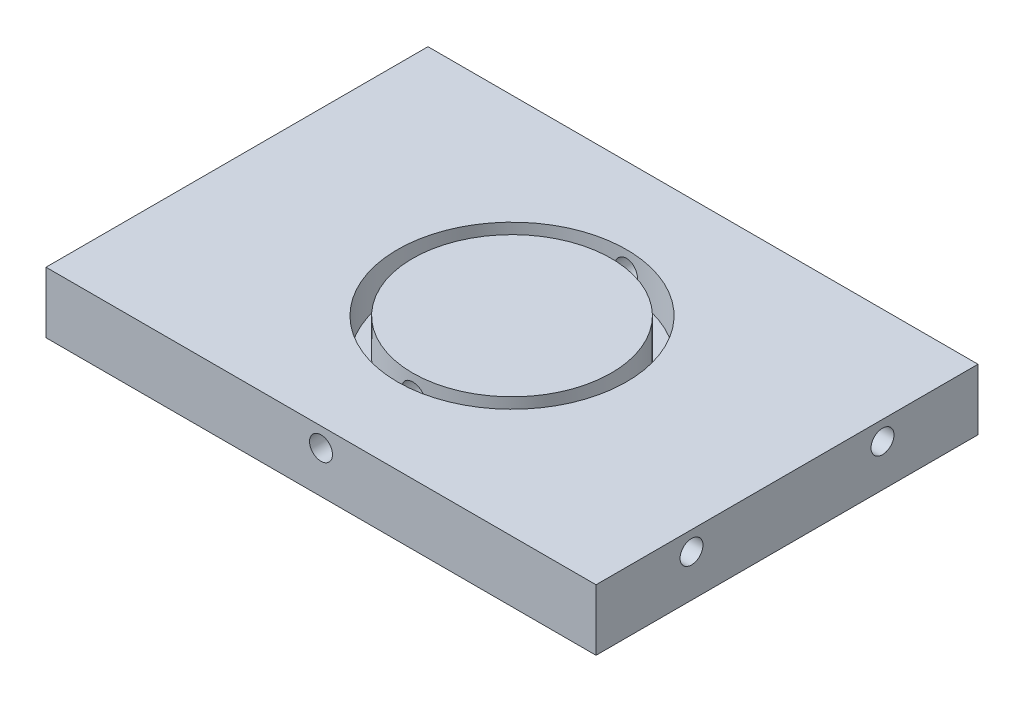
ISO-10303-21;
HEADER;
FILE_DESCRIPTION(('STEP AP214'),'2;1');
FILE_NAME('part.step','',(''),(''),'','','');
FILE_SCHEMA(('AUTOMOTIVE_DESIGN { 1 0 10303 214 1 1 1 1 }'));
ENDSEC;
DATA;
#1=APPLICATION_CONTEXT('core data for automotive mechanical design processes');
#2=APPLICATION_PROTOCOL_DEFINITION('international standard','automotive_design',2000,#1);
#3=PRODUCT_CONTEXT('',#1,'mechanical');
#4=PRODUCT('Part','Part','',(#3));
#5=PRODUCT_RELATED_PRODUCT_CATEGORY('part','',(#4));
#6=PRODUCT_DEFINITION_FORMATION('','',#4);
#7=PRODUCT_DEFINITION_CONTEXT('part definition',#1,'design');
#8=PRODUCT_DEFINITION('design','',#6,#7);
#9=PRODUCT_DEFINITION_SHAPE('','',#8);
#10=(LENGTH_UNIT() NAMED_UNIT(*) SI_UNIT(.MILLI.,.METRE.));
#11=(NAMED_UNIT(*) PLANE_ANGLE_UNIT() SI_UNIT($,.RADIAN.));
#12=(NAMED_UNIT(*) SI_UNIT($,.STERADIAN.) SOLID_ANGLE_UNIT());
#13=UNCERTAINTY_MEASURE_WITH_UNIT(LENGTH_MEASURE(1.E-05),#10,'distance_accuracy_value','');
#14=(GEOMETRIC_REPRESENTATION_CONTEXT(3) GLOBAL_UNCERTAINTY_ASSIGNED_CONTEXT((#13)) GLOBAL_UNIT_ASSIGNED_CONTEXT((#10,
#11,#12)) REPRESENTATION_CONTEXT('',''));
#15=CARTESIAN_POINT('',(0.,0.,0.));
#16=DIRECTION('',(0.,0.,1.));
#17=DIRECTION('',(1.,0.,0.));
#18=AXIS2_PLACEMENT_3D('',#15,#16,#17);
#19=CARTESIAN_POINT('',(-5.5,-45.,50.));
#20=DIRECTION('',(1.,0.,0.));
#21=DIRECTION('',(0.,1.,0.));
#22=AXIS2_PLACEMENT_3D('',#19,#20,#21);
#23=PLANE('',#22);
#24=CARTESIAN_POINT('',(-5.50000000000004,-47.5,12.5));
#25=DIRECTION('',(-1.,0.,0.));
#26=DIRECTION('',(0.,0.,1.));
#27=AXIS2_PLACEMENT_3D('',#24,#25,#26);
#28=CIRCLE('',#27,1.5);
#29=CARTESIAN_POINT('',(-5.50000000000004,-47.5,14.));
#30=VERTEX_POINT('',#29);
#31=EDGE_CURVE('E202',#30,#30,#28,.T.);
#32=ORIENTED_EDGE('',*,*,#31,.F.);
#33=EDGE_LOOP('',(#32));
#34=FACE_BOUND('',#33,.T.);
#35=CARTESIAN_POINT('',(-5.50000000000004,-47.5,37.5));
#36=DIRECTION('',(-1.,0.,0.));
#37=DIRECTION('',(0.,0.,1.));
#38=AXIS2_PLACEMENT_3D('',#35,#36,#37);
#39=CIRCLE('',#38,1.5);
#40=CARTESIAN_POINT('',(-5.50000000000004,-47.5,39.));
#41=VERTEX_POINT('',#40);
#42=EDGE_CURVE('E205',#41,#41,#39,.T.);
#43=ORIENTED_EDGE('',*,*,#42,.F.);
#44=EDGE_LOOP('',(#43));
#45=FACE_BOUND('',#44,.T.);
#46=DIRECTION('',(0.,-1.,0.));
#47=VECTOR('',#46,1.);
#48=CARTESIAN_POINT('',(-5.5,-45.,0.));
#49=LINE('',#48,#47);
#50=CARTESIAN_POINT('',(-5.5,-45.,0.));
#51=VERTEX_POINT('',#50);
#52=CARTESIAN_POINT('',(-5.5,-53.,0.));
#53=VERTEX_POINT('',#52);
#54=EDGE_CURVE('E115',#51,#53,#49,.T.);
#55=ORIENTED_EDGE('',*,*,#54,.T.);
#56=DIRECTION('',(0.,0.,-1.));
#57=VECTOR('',#56,1.);
#58=CARTESIAN_POINT('',(-5.5,-53.,50.));
#59=LINE('',#58,#57);
#60=CARTESIAN_POINT('',(-5.5,-53.,50.));
#61=VERTEX_POINT('',#60);
#62=EDGE_CURVE('E11',#61,#53,#59,.T.);
#63=ORIENTED_EDGE('',*,*,#62,.F.);
#64=DIRECTION('',(0.,-1.,0.));
#65=VECTOR('',#64,1.);
#66=CARTESIAN_POINT('',(-5.5,-45.,50.));
#67=LINE('',#66,#65);
#68=CARTESIAN_POINT('',(-5.5,-45.,50.));
#69=VERTEX_POINT('',#68);
#70=EDGE_CURVE('E96',#69,#61,#67,.T.);
#71=ORIENTED_EDGE('',*,*,#70,.F.);
#72=DIRECTION('',(0.,0.,-1.));
#73=VECTOR('',#72,1.);
#74=CARTESIAN_POINT('',(-5.5,-45.,50.));
#75=LINE('',#74,#73);
#76=EDGE_CURVE('E63',#69,#51,#75,.T.);
#77=ORIENTED_EDGE('',*,*,#76,.T.);
#78=EDGE_LOOP('',(#55,#63,#71,#77));
#79=FACE_BOUND('',#78,.T.);
#80=ADVANCED_FACE('F39',(#34,#45,#79),#23,.F.);
#81=CARTESIAN_POINT('',(-5.5,-53.,50.));
#82=DIRECTION('',(0.,1.,0.));
#83=DIRECTION('',(0.,0.,1.));
#84=AXIS2_PLACEMENT_3D('',#81,#82,#83);
#85=PLANE('',#84);
#86=DIRECTION('',(1.,0.,0.));
#87=VECTOR('',#86,1.);
#88=CARTESIAN_POINT('',(-5.5,-53.,0.));
#89=LINE('',#88,#87);
#90=CARTESIAN_POINT('',(66.5,-53.,0.));
#91=VERTEX_POINT('',#90);
#92=EDGE_CURVE('E102',#53,#91,#89,.T.);
#93=ORIENTED_EDGE('',*,*,#92,.T.);
#94=DIRECTION('',(0.,0.,-1.));
#95=VECTOR('',#94,1.);
#96=CARTESIAN_POINT('',(66.5,-53.,50.));
#97=LINE('',#96,#95);
#98=CARTESIAN_POINT('',(66.5,-53.,50.));
#99=VERTEX_POINT('',#98);
#100=EDGE_CURVE('E54',#99,#91,#97,.T.);
#101=ORIENTED_EDGE('',*,*,#100,.F.);
#102=DIRECTION('',(1.,0.,0.));
#103=VECTOR('',#102,1.);
#104=CARTESIAN_POINT('',(-5.5,-53.,50.));
#105=LINE('',#104,#103);
#106=EDGE_CURVE('E88',#61,#99,#105,.T.);
#107=ORIENTED_EDGE('',*,*,#106,.F.);
#108=ORIENTED_EDGE('',*,*,#62,.T.);
#109=EDGE_LOOP('',(#93,#101,#107,#108));
#110=FACE_BOUND('',#109,.T.);
#111=ADVANCED_FACE('F101',(#110),#85,.F.);
#112=CARTESIAN_POINT('',(66.5,-45.,50.));
#113=DIRECTION('',(1.,0.,0.));
#114=DIRECTION('',(0.,0.,-1.));
#115=AXIS2_PLACEMENT_3D('',#112,#113,#114);
#116=PLANE('',#115);
#117=CARTESIAN_POINT('',(66.5,-47.5,37.5));
#118=DIRECTION('',(1.,0.,0.));
#119=DIRECTION('',(0.,0.,-1.));
#120=AXIS2_PLACEMENT_3D('',#117,#118,#119);
#121=CIRCLE('',#120,1.5);
#122=CARTESIAN_POINT('',(66.5,-47.5,36.));
#123=VERTEX_POINT('',#122);
#124=EDGE_CURVE('E245',#123,#123,#121,.T.);
#125=ORIENTED_EDGE('',*,*,#124,.F.);
#126=EDGE_LOOP('',(#125));
#127=FACE_BOUND('',#126,.T.);
#128=CARTESIAN_POINT('',(66.5,-47.5,12.5));
#129=DIRECTION('',(1.,0.,0.));
#130=DIRECTION('',(0.,0.,-1.));
#131=AXIS2_PLACEMENT_3D('',#128,#129,#130);
#132=CIRCLE('',#131,1.5);
#133=CARTESIAN_POINT('',(66.5,-47.5,11.));
#134=VERTEX_POINT('',#133);
#135=EDGE_CURVE('E237',#134,#134,#132,.T.);
#136=ORIENTED_EDGE('',*,*,#135,.F.);
#137=EDGE_LOOP('',(#136));
#138=FACE_BOUND('',#137,.T.);
#139=DIRECTION('',(0.,-1.,0.));
#140=VECTOR('',#139,1.);
#141=CARTESIAN_POINT('',(66.5,-45.,0.));
#142=LINE('',#141,#140);
#143=CARTESIAN_POINT('',(66.5,-45.,0.));
#144=VERTEX_POINT('',#143);
#145=EDGE_CURVE('E121',#144,#91,#142,.T.);
#146=ORIENTED_EDGE('',*,*,#145,.F.);
#147=DIRECTION('',(0.,0.,-1.));
#148=VECTOR('',#147,1.);
#149=CARTESIAN_POINT('',(66.5,-45.,50.));
#150=LINE('',#149,#148);
#151=CARTESIAN_POINT('',(66.5,-45.,50.));
#152=VERTEX_POINT('',#151);
#153=EDGE_CURVE('E77',#152,#144,#150,.T.);
#154=ORIENTED_EDGE('',*,*,#153,.F.);
#155=DIRECTION('',(0.,-1.,0.));
#156=VECTOR('',#155,1.);
#157=CARTESIAN_POINT('',(66.5,-45.,50.));
#158=LINE('',#157,#156);
#159=EDGE_CURVE('E95',#152,#99,#158,.T.);
#160=ORIENTED_EDGE('',*,*,#159,.T.);
#161=ORIENTED_EDGE('',*,*,#100,.T.);
#162=EDGE_LOOP('',(#146,#154,#160,#161));
#163=FACE_BOUND('',#162,.T.);
#164=ADVANCED_FACE('F107',(#127,#138,#163),#116,.T.);
#165=CARTESIAN_POINT('',(-5.5,-45.,50.));
#166=DIRECTION('',(0.,1.,0.));
#167=DIRECTION('',(0.,0.,1.));
#168=AXIS2_PLACEMENT_3D('',#165,#166,#167);
#169=PLANE('',#168);
#170=CARTESIAN_POINT('',(30.5,-45.,25.));
#171=DIRECTION('',(0.,1.,0.));
#172=DIRECTION('',(0.,0.,1.));
#173=AXIS2_PLACEMENT_3D('',#170,#171,#172);
#174=CIRCLE('',#173,15.);
#175=CARTESIAN_POINT('',(30.5,-45.,40.));
#176=VERTEX_POINT('',#175);
#177=EDGE_CURVE('E209',#176,#176,#174,.T.);
#178=ORIENTED_EDGE('',*,*,#177,.F.);
#179=EDGE_LOOP('',(#178));
#180=FACE_BOUND('',#179,.T.);
#181=DIRECTION('',(1.,0.,0.));
#182=VECTOR('',#181,1.);
#183=CARTESIAN_POINT('',(-5.5,-45.,0.));
#184=LINE('',#183,#182);
#185=EDGE_CURVE('E124',#51,#144,#184,.T.);
#186=ORIENTED_EDGE('',*,*,#185,.F.);
#187=ORIENTED_EDGE('',*,*,#76,.F.);
#188=DIRECTION('',(1.,0.,0.));
#189=VECTOR('',#188,1.);
#190=CARTESIAN_POINT('',(-5.5,-45.,50.));
#191=LINE('',#190,#189);
#192=EDGE_CURVE('E109',#69,#152,#191,.T.);
#193=ORIENTED_EDGE('',*,*,#192,.T.);
#194=ORIENTED_EDGE('',*,*,#153,.T.);
#195=EDGE_LOOP('',(#186,#187,#193,#194));
#196=FACE_BOUND('',#195,.T.);
#197=ADVANCED_FACE('F181',(#180,#196),#169,.T.);
#198=CARTESIAN_POINT('',(0.,0.,50.));
#199=DIRECTION('',(0.,0.,1.));
#200=DIRECTION('',(1.,0.,0.));
#201=AXIS2_PLACEMENT_3D('',#198,#199,#200);
#202=PLANE('',#201);
#203=CARTESIAN_POINT('',(30.5,-47.5,50.));
#204=DIRECTION('',(0.,0.,-1.));
#205=DIRECTION('',(-1.,0.,0.));
#206=AXIS2_PLACEMENT_3D('',#203,#204,#205);
#207=CIRCLE('',#206,1.5);
#208=CARTESIAN_POINT('',(29.,-47.5,50.));
#209=VERTEX_POINT('',#208);
#210=EDGE_CURVE('E137',#209,#209,#207,.T.);
#211=ORIENTED_EDGE('',*,*,#210,.T.);
#212=EDGE_LOOP('',(#211));
#213=FACE_BOUND('',#212,.T.);
#214=ORIENTED_EDGE('',*,*,#70,.T.);
#215=ORIENTED_EDGE('',*,*,#106,.T.);
#216=ORIENTED_EDGE('',*,*,#159,.F.);
#217=ORIENTED_EDGE('',*,*,#192,.F.);
#218=EDGE_LOOP('',(#214,#215,#216,#217));
#219=FACE_BOUND('',#218,.T.);
#220=ADVANCED_FACE('F92',(#213,#219),#202,.T.);
#221=CARTESIAN_POINT('',(0.,0.,0.));
#222=DIRECTION('',(0.,0.,1.));
#223=DIRECTION('',(1.,0.,0.));
#224=AXIS2_PLACEMENT_3D('',#221,#222,#223);
#225=PLANE('',#224);
#226=CARTESIAN_POINT('',(30.5,-47.5,0.));
#227=DIRECTION('',(0.,0.,-1.));
#228=DIRECTION('',(-1.,0.,0.));
#229=AXIS2_PLACEMENT_3D('',#226,#227,#228);
#230=CIRCLE('',#229,1.5);
#231=CARTESIAN_POINT('',(29.,-47.5,0.));
#232=VERTEX_POINT('',#231);
#233=EDGE_CURVE('E165',#232,#232,#230,.T.);
#234=ORIENTED_EDGE('',*,*,#233,.F.);
#235=EDGE_LOOP('',(#234));
#236=FACE_BOUND('',#235,.T.);
#237=ORIENTED_EDGE('',*,*,#54,.F.);
#238=ORIENTED_EDGE('',*,*,#185,.T.);
#239=ORIENTED_EDGE('',*,*,#145,.T.);
#240=ORIENTED_EDGE('',*,*,#92,.F.);
#241=EDGE_LOOP('',(#237,#238,#239,#240));
#242=FACE_BOUND('',#241,.T.);
#243=ADVANCED_FACE('F176',(#236,#242),#225,.F.);
#244=CARTESIAN_POINT('',(30.5,-50.,25.));
#245=DIRECTION('',(0.,1.,0.));
#246=DIRECTION('',(0.,0.,1.));
#247=AXIS2_PLACEMENT_3D('',#244,#245,#246);
#248=CYLINDRICAL_SURFACE('',#247,15.);
#249=CARTESIAN_POINT('',(30.5,-49.,40.));
#250=CARTESIAN_POINT('',(30.5840305306873,-48.9999963611494,39.9999990328115));
#251=CARTESIAN_POINT('',(30.6681166177517,-48.9929150966553,39.9992863839431));
#252=CARTESIAN_POINT('',(30.8339575977453,-48.9647734445644,39.9965120139211));
#253=CARTESIAN_POINT('',(30.9157098187533,-48.9436976559631,39.9944488065104));
#254=CARTESIAN_POINT('',(31.0744575131801,-48.8881866391033,39.989206218446));
#255=CARTESIAN_POINT('',(31.1514558269224,-48.8537594792223,39.9860275120106));
#256=CARTESIAN_POINT('',(31.2985642414406,-48.7725386381025,39.9789093609146));
#257=CARTESIAN_POINT('',(31.3686757081686,-48.7257474159998,39.974970067572));
#258=CARTESIAN_POINT('',(31.5002893260111,-48.6209459535066,39.9667561651199));
#259=CARTESIAN_POINT('',(31.5617632172523,-48.562900300897,39.962480523608));
#260=CARTESIAN_POINT('',(31.6741137821465,-48.4373131986055,39.9540843535939));
#261=CARTESIAN_POINT('',(31.724989965624,-48.3697713099364,39.9499638322737));
#262=CARTESIAN_POINT('',(31.8148009556654,-48.2269322024746,39.9423338732918));
#263=CARTESIAN_POINT('',(31.8537101981823,-48.1516188338577,39.9388257506636));
#264=CARTESIAN_POINT('',(31.9183195771141,-47.9954866211425,39.9328305631979));
#265=CARTESIAN_POINT('',(31.9440200398869,-47.9146679131241,39.9303434731333));
#266=CARTESIAN_POINT('',(31.9813985624028,-47.750107298701,39.9266812610947));
#267=CARTESIAN_POINT('',(31.9931234795057,-47.6663761347217,39.9255017559714));
#268=CARTESIAN_POINT('',(32.0023629277031,-47.4981267049063,39.9245746459079));
#269=CARTESIAN_POINT('',(31.9998778323062,-47.4136084598169,39.9248270033312));
#270=CARTESIAN_POINT('',(31.980806420379,-47.24650703546,39.926731103484));
#271=CARTESIAN_POINT('',(31.9642712661868,-47.163917951007,39.9283777688598));
#272=CARTESIAN_POINT('',(31.9176487162259,-47.0026930551984,39.9328770143113));
#273=CARTESIAN_POINT('',(31.8875611373836,-46.9240572972625,39.9357296106774));
#274=CARTESIAN_POINT('',(31.8146313408223,-46.7728096190517,39.942325141781));
#275=CARTESIAN_POINT('',(31.77176642408,-46.700208715766,39.9460696586224));
#276=CARTESIAN_POINT('',(31.6745150410298,-46.5632121776322,39.9540257759932));
#277=CARTESIAN_POINT('',(31.6201282375048,-46.4988167830274,39.9582373901918));
#278=CARTESIAN_POINT('',(31.5010911686181,-46.3797619090165,39.9666757796948));
#279=CARTESIAN_POINT('',(31.4363967182771,-46.3251465971788,39.970902539995));
#280=CARTESIAN_POINT('',(31.2987342226057,-46.2275445506344,39.9788774361778));
#281=CARTESIAN_POINT('',(31.2257661679994,-46.1845578289653,39.9826255715238));
#282=CARTESIAN_POINT('',(31.0735971585386,-46.1114349695346,39.9892221350064));
#283=CARTESIAN_POINT('',(30.9943951195849,-46.0813010727729,39.9920704062215));
#284=CARTESIAN_POINT('',(30.8320208259949,-46.0347716249324,39.9965447116211));
#285=CARTESIAN_POINT('',(30.7488486901649,-46.0183756630141,39.9981707823559));
#286=CARTESIAN_POINT('',(30.5812776486379,-45.9998435383979,40.0000127750247));
#287=CARTESIAN_POINT('',(30.4968855468418,-45.9976464276213,40.000234724016));
#288=CARTESIAN_POINT('',(30.3289343100265,-46.0074142945731,39.999259626352));
#289=CARTESIAN_POINT('',(30.2453751637693,-46.0193790809729,39.998062598867));
#290=CARTESIAN_POINT('',(30.081637689748,-46.0570805431324,39.9943879230879));
#291=CARTESIAN_POINT('',(30.001452726542,-46.082788681717,39.9919129287706));
#292=CARTESIAN_POINT('',(29.8465335179243,-46.1472177610559,39.9859599829091));
#293=CARTESIAN_POINT('',(29.7717993947643,-46.1859389935591,39.9824820088788));
#294=CARTESIAN_POINT('',(29.6296277297418,-46.2754462579959,39.9748971299563));
#295=CARTESIAN_POINT('',(29.5622155103766,-46.3262723333887,39.9707881540516));
#296=CARTESIAN_POINT('',(29.4368575650322,-46.4384891016114,39.9624089930428));
#297=CARTESIAN_POINT('',(29.3789120767262,-46.4998800596055,39.9581388038946));
#298=CARTESIAN_POINT('',(29.2739208351693,-46.6317498619885,39.9499003621113));
#299=CARTESIAN_POINT('',(29.2269150819807,-46.7022606348139,39.9459332520846));
#300=CARTESIAN_POINT('',(29.1454126118843,-46.85021104022,39.9387674869133));
#301=CARTESIAN_POINT('',(29.1109157239192,-46.9276505780326,39.9355688212606));
#302=CARTESIAN_POINT('',(29.0554771869733,-47.0871231091987,39.9303092145107));
#303=CARTESIAN_POINT('',(29.0345117377822,-47.1691477601367,39.9282462767468));
#304=CARTESIAN_POINT('',(29.0066539893058,-47.3355747969412,39.9254854792432));
#305=CARTESIAN_POINT('',(28.9997612864007,-47.4199771145435,39.9247875803528));
#306=CARTESIAN_POINT('',(29.0002502922931,-47.5883660325351,39.9248366966134));
#307=CARTESIAN_POINT('',(29.0075691656103,-47.6723528243242,39.9255773513051));
#308=CARTESIAN_POINT('',(29.0361418205545,-47.8378973757524,39.9284065583432));
#309=CARTESIAN_POINT('',(29.0573956178568,-47.919455132659,39.9304951122058));
#310=CARTESIAN_POINT('',(29.1132174705537,-48.0778260235718,39.9357830239478));
#311=CARTESIAN_POINT('',(29.1477836834886,-48.1546398124446,39.9389822281054));
#312=CARTESIAN_POINT('',(29.2292426676334,-48.3013853375066,39.9461312775904));
#313=CARTESIAN_POINT('',(29.2761353698169,-48.371317112231,39.9500811187143));
#314=CARTESIAN_POINT('',(29.381152165572,-48.5026355117079,39.9583073081455));
#315=CARTESIAN_POINT('',(29.4393230766646,-48.5639846145506,39.9625849709013));
#316=CARTESIAN_POINT('',(29.5651524511623,-48.6760783490495,39.9709728209317));
#317=CARTESIAN_POINT('',(29.6328131838376,-48.7268204370358,39.9750829678446));
#318=CARTESIAN_POINT('',(29.7758878487581,-48.8163601807819,39.9826834310374));
#319=CARTESIAN_POINT('',(29.8513208759799,-48.8551274364178,39.9861721604022));
#320=CARTESIAN_POINT('',(30.0076125813492,-48.9193936342358,39.9921194387484));
#321=CARTESIAN_POINT('',(30.0884650252616,-48.9449075364303,39.9945791486448));
#322=CARTESIAN_POINT('',(30.2248126078915,-48.9755809256272,39.997573206606));
#323=CARTESIAN_POINT('',(30.2794361707332,-48.9847255664491,39.9984790103775));
#324=CARTESIAN_POINT('',(30.389365128774,-48.9969362890927,39.9996927242618));
#325=CARTESIAN_POINT('',(30.4446705211602,-49.0000023959828,40.0000006368404));
#326=CARTESIAN_POINT('',(30.5,-49.,40.));
#327=B_SPLINE_CURVE_WITH_KNOTS('',3,(#249,#250,#251,#252,#253,#254,#255,#256,#257,#258,#259,
#260,#261,#262,#263,#264,#265,#266,#267,#268,#269,#270,#271,#272,#273,#274,#275,#276,#277,#278,
#279,#280,#281,#282,#283,#284,#285,#286,#287,#288,#289,#290,#291,#292,#293,#294,#295,#296,#297,
#298,#299,#300,#301,#302,#303,#304,#305,#306,#307,#308,#309,#310,#311,#312,#313,#314,#315,#316,
#317,#318,#319,#320,#321,#322,#323,#324,#325,#326),.UNSPECIFIED.,.T.,.F.,(4,2,2,2,2,2,2,2,2,2,2,
2,2,2,2,2,2,2,2,2,2,2,2,2,2,2,2,2,2,2,2,2,2,2,2,2,2,2,4),(0.,0.251889549402713,
0.504056764253232,0.756071828598307,1.00803680637418,1.26080785293442,1.51359058831059,
1.76690963208333,2.02022241663757,2.27268348067796,2.52513790883665,2.77667696161667,
3.02821941242452,3.28021142059344,3.53221080496689,3.7853210129431,4.03843150469659,
4.29158611040374,4.54473314513161,4.79679282911638,5.04884910778716,5.30038402941459,
5.55192459074202,5.80430911123049,6.05669996715347,6.309999654129,6.56329587713063,
6.81614535889506,7.0689875885938,7.32071443940936,7.57244157339061,7.82413388044202,
8.07582477808443,8.32858376141482,8.58140328955439,8.83485946539366,9.08802892192945,
9.25388500848525,9.41974041103543),.UNSPECIFIED.);
#328=CARTESIAN_POINT('',(30.5,-49.,40.));
#329=VERTEX_POINT('',#328);
#330=EDGE_CURVE('E164',#329,#329,#327,.T.);
#331=ORIENTED_EDGE('',*,*,#330,.T.);
#332=EDGE_LOOP('',(#331));
#333=FACE_BOUND('',#332,.T.);
#334=CARTESIAN_POINT('',(29.,-47.5,10.0751884434007));
#335=CARTESIAN_POINT('',(29.0000036399097,-47.4159706537396,10.0751874580465));
#336=CARTESIAN_POINT('',(29.0070847115263,-47.3318857473822,10.0744711450867));
#337=CARTESIAN_POINT('',(29.0352255278547,-47.1660472205597,10.0716836866282));
#338=CARTESIAN_POINT('',(29.0563006776704,-47.0842962729438,10.0696110480817));
#339=CARTESIAN_POINT('',(29.1118098258966,-46.9255512711731,10.0643480042892));
#340=CARTESIAN_POINT('',(29.1462357255592,-46.8485543659128,10.0611582767982));
#341=CARTESIAN_POINT('',(29.2274535989133,-46.7014483115624,10.0540212914227));
#342=CARTESIAN_POINT('',(29.2742431165611,-46.6313377982744,10.0500741840351));
#343=CARTESIAN_POINT('',(29.3790428570019,-46.4997231045137,10.0418510993515));
#344=CARTESIAN_POINT('',(29.4370888728376,-46.4382474857443,10.037574099921));
#345=CARTESIAN_POINT('',(29.5626774270207,-46.3258935864946,10.0291824214642));
#346=CARTESIAN_POINT('',(29.6302203996402,-46.2750157908905,10.0250677498718));
#347=CARTESIAN_POINT('',(29.7730604575235,-46.1852031144893,10.0174542526659));
#348=CARTESIAN_POINT('',(29.8483735062057,-46.1462935018095,10.0139567365803));
#349=CARTESIAN_POINT('',(30.0045050235687,-46.081683350277,10.0079827468634));
#350=CARTESIAN_POINT('',(30.0853233579977,-46.0559824894458,10.005506248344));
#351=CARTESIAN_POINT('',(30.2498828258856,-46.0186031359701,10.0018605014346));
#352=CARTESIAN_POINT('',(30.3336132094526,-46.0068777508751,10.0006868823578));
#353=CARTESIAN_POINT('',(30.5018611110334,-45.9976370962994,9.99976426601962));
#354=CARTESIAN_POINT('',(30.5863786085817,-46.0001214583806,10.0000152318209));
#355=CARTESIAN_POINT('',(30.7534832660968,-46.0191917089752,10.0019099303322));
#356=CARTESIAN_POINT('',(30.8360762449025,-46.0357271733458,10.0035486827243));
#357=CARTESIAN_POINT('',(30.9973087692568,-46.0823516934199,10.0080290610261));
#358=CARTESIAN_POINT('',(31.0759482634366,-46.1124409251814,10.0108707025607));
#359=CARTESIAN_POINT('',(31.2272004720194,-46.1853741448817,10.0174459377413));
#360=CARTESIAN_POINT('',(31.2998023564725,-46.2282404462952,10.0211810895136));
#361=CARTESIAN_POINT('',(31.4368002697613,-46.3254947850046,10.0291242322089));
#362=CARTESIAN_POINT('',(31.5011960578413,-46.3798831602178,10.0333322369978));
#363=CARTESIAN_POINT('',(31.620249157734,-46.4989213442705,10.0417705979822));
#364=CARTESIAN_POINT('',(31.6748626192855,-46.5636150171124,10.0460009714046));
#365=CARTESIAN_POINT('',(31.7724613030369,-46.7012752978162,10.0539889010767));
#366=CARTESIAN_POINT('',(31.8154465083694,-46.7742419176782,10.0577464566405));
#367=CARTESIAN_POINT('',(31.8885682768599,-46.9264105377997,10.0643636572878));
#368=CARTESIAN_POINT('',(31.9187021308594,-47.0056138486343,10.0672231130117));
#369=CARTESIAN_POINT('',(31.9652311034564,-47.167990906922,10.0717164719359));
#370=CARTESIAN_POINT('',(31.9816266406146,-47.2511645333312,10.0733504124735));
#371=CARTESIAN_POINT('',(32.0001571630879,-47.4187362692943,10.0752012920888));
#372=CARTESIAN_POINT('',(32.0023534949708,-47.5031275303973,10.075424326786));
#373=CARTESIAN_POINT('',(31.9925843703071,-47.6710768987343,10.0744442296784));
#374=CARTESIAN_POINT('',(31.9806191051146,-47.7546350172106,10.0732411171441));
#375=CARTESIAN_POINT('',(31.9429177617613,-47.9183673734175,10.069549833664));
#376=CARTESIAN_POINT('',(31.9172106907834,-47.998548356642,10.0670643699798));
#377=CARTESIAN_POINT('',(31.8527850795139,-48.1534600775955,10.0610906344181));
#378=CARTESIAN_POINT('',(31.8140662411754,-48.2281906904308,10.05760233957));
#379=CARTESIAN_POINT('',(31.7245625021348,-48.3703599610432,10.0500012346643));
#380=CARTESIAN_POINT('',(31.673736949761,-48.4377729129494,10.0458863377799));
#381=CARTESIAN_POINT('',(31.5615208001768,-48.5631325799111,10.0375025106222));
#382=CARTESIAN_POINT('',(31.5001299413722,-48.6210790605101,10.033233576537));
#383=CARTESIAN_POINT('',(31.3682597063397,-48.7260724500971,10.0250042822605));
#384=CARTESIAN_POINT('',(31.2977483839542,-48.7730793393793,10.0210450891679));
#385=CARTESIAN_POINT('',(31.1497965761257,-48.8545838027596,10.0138983684006));
#386=CARTESIAN_POINT('',(31.0723561856444,-48.8890815482607,10.0107108301526));
#387=CARTESIAN_POINT('',(30.9128841896492,-48.944520651483,10.0054718437899));
#388=CARTESIAN_POINT('',(30.8308610564749,-48.9654861809878,10.0034183709153));
#389=CARTESIAN_POINT('',(30.6644372209755,-48.9933446043698,10.0006705807953));
#390=CARTESIAN_POINT('',(30.5800365855383,-49.0002378937511,9.99997622535156));
#391=CARTESIAN_POINT('',(30.4116466638864,-48.9997506003401,10.000024925301));
#392=CARTESIAN_POINT('',(30.3276571891632,-48.992432144745,10.00076172435));
#393=CARTESIAN_POINT('',(30.1621071674655,-48.9638593815145,10.0035775963361));
#394=CARTESIAN_POINT('',(30.0805466223975,-48.9426050629406,10.0056566703269));
#395=CARTESIAN_POINT('',(29.9221701368484,-48.8867811139106,10.0109241427906));
#396=CARTESIAN_POINT('',(29.8453535508837,-48.8522132995988,10.0141123899513));
#397=CARTESIAN_POINT('',(29.6986030997678,-48.7707502466245,10.0212428137556));
#398=CARTESIAN_POINT('',(29.6286691943472,-48.7238550800933,10.0251849859877));
#399=CARTESIAN_POINT('',(29.4973509133596,-48.6188355714644,10.0334022299642));
#400=CARTESIAN_POINT('',(29.436003610671,-48.5606649756328,10.0376786280895));
#401=CARTESIAN_POINT('',(29.3239133609103,-48.4348369726818,10.0460711384551));
#402=CARTESIAN_POINT('',(29.2731729622282,-48.3671772922464,10.0501872119834));
#403=CARTESIAN_POINT('',(29.1836350393639,-48.2241034871201,10.057804248841));
#404=CARTESIAN_POINT('',(29.1448682180077,-48.1486700780139,10.0613036211204));
#405=CARTESIAN_POINT('',(29.0806029378519,-47.9923775631307,10.0672720785631));
#406=CARTESIAN_POINT('',(29.0550895131652,-47.9115246941114,10.0697423251996));
#407=CARTESIAN_POINT('',(29.0244174674997,-47.7751783886513,10.0727498869278));
#408=CARTESIAN_POINT('',(29.0152734314027,-47.7205566230404,10.0736600209646));
#409=CARTESIAN_POINT('',(29.0030635120923,-47.6106312654362,10.0748796223351));
#410=CARTESIAN_POINT('',(28.9999976033641,-47.5553276763061,10.0751890921902));
#411=CARTESIAN_POINT('',(29.,-47.5,10.0751884434007));
#412=B_SPLINE_CURVE_WITH_KNOTS('',3,(#334,#335,#336,#337,#338,#339,#340,#341,#342,#343,#344,
#345,#346,#347,#348,#349,#350,#351,#352,#353,#354,#355,#356,#357,#358,#359,#360,#361,#362,#363,
#364,#365,#366,#367,#368,#369,#370,#371,#372,#373,#374,#375,#376,#377,#378,#379,#380,#381,#382,
#383,#384,#385,#386,#387,#388,#389,#390,#391,#392,#393,#394,#395,#396,#397,#398,#399,#400,#401,
#402,#403,#404,#405,#406,#407,#408,#409,#410,#411),.UNSPECIFIED.,.T.,.F.,(4,2,2,2,2,2,2,2,2,2,2,
2,2,2,2,2,2,2,2,2,2,2,2,2,2,2,2,2,2,2,2,2,2,2,2,2,2,2,4),(0.,0.251885991654698,
0.504049727732654,0.756060736496216,1.00802172063198,1.26079742294889,1.5135846878288,
1.76690204956938,2.02021323611693,2.27267206347675,2.52512434497349,2.77667447727993,
3.02822787721463,3.28022318199622,3.53222587827795,3.78533137627503,4.03843724141346,
4.29159643676902,4.54474791892551,4.7968049446165,5.04885856450308,5.30038222056793,
5.55191163841573,5.80429784717579,6.05669030584805,6.30999205227178,6.56329032777009,
6.81613489041544,7.06897234669726,7.32070700202726,7.57244185494989,7.82414237992871,
8.075841432162,8.32859572556985,8.5814106755179,8.83486861605717,9.08803972341004,
9.25389041409072,9.41974040855725),.UNSPECIFIED.);
#413=CARTESIAN_POINT('',(29.,-47.5,10.0751884434007));
#414=VERTEX_POINT('',#413);
#415=EDGE_CURVE('E156',#414,#414,#412,.T.);
#416=ORIENTED_EDGE('',*,*,#415,.T.);
#417=EDGE_LOOP('',(#416));
#418=FACE_BOUND('',#417,.T.);
#419=CARTESIAN_POINT('',(30.5,-50.,25.));
#420=DIRECTION('',(0.,1.,0.));
#421=DIRECTION('',(0.,0.,1.));
#422=AXIS2_PLACEMENT_3D('',#419,#420,#421);
#423=CIRCLE('',#422,15.);
#424=CARTESIAN_POINT('',(30.5,-50.,40.));
#425=VERTEX_POINT('',#424);
#426=EDGE_CURVE('E118',#425,#425,#423,.T.);
#427=ORIENTED_EDGE('',*,*,#426,.F.);
#428=EDGE_LOOP('',(#427));
#429=FACE_BOUND('',#428,.T.);
#430=ORIENTED_EDGE('',*,*,#177,.T.);
#431=EDGE_LOOP('',(#430));
#432=FACE_BOUND('',#431,.T.);
#433=ADVANCED_FACE('F171',(#333,#418,#429,#432),#248,.F.);
#434=CARTESIAN_POINT('',(30.5,-50.,25.));
#435=DIRECTION('',(0.,1.,0.));
#436=DIRECTION('',(0.,0.,1.));
#437=AXIS2_PLACEMENT_3D('',#434,#435,#436);
#438=PLANE('',#437);
#439=CARTESIAN_POINT('',(30.5,-50.,25.));
#440=DIRECTION('',(0.,1.,0.));
#441=DIRECTION('',(0.,0.,1.));
#442=AXIS2_PLACEMENT_3D('',#439,#440,#441);
#443=CIRCLE('',#442,13.);
#444=CARTESIAN_POINT('',(30.5,-50.,38.));
#445=VERTEX_POINT('',#444);
#446=EDGE_CURVE('E213',#445,#445,#443,.T.);
#447=ORIENTED_EDGE('',*,*,#446,.F.);
#448=EDGE_LOOP('',(#447));
#449=FACE_BOUND('',#448,.T.);
#450=ORIENTED_EDGE('',*,*,#426,.T.);
#451=EDGE_LOOP('',(#450));
#452=FACE_BOUND('',#451,.T.);
#453=ADVANCED_FACE('F175',(#449,#452),#438,.T.);
#454=CARTESIAN_POINT('',(30.5,-50.,25.));
#455=DIRECTION('',(0.,1.,0.));
#456=DIRECTION('',(0.,0.,1.));
#457=AXIS2_PLACEMENT_3D('',#454,#455,#456);
#458=CYLINDRICAL_SURFACE('',#457,13.);
#459=CARTESIAN_POINT('',(30.5,-49.,38.));
#460=CARTESIAN_POINT('',(30.5839563147427,-48.9999964031671,37.9999989044515));
#461=CARTESIAN_POINT('',(30.6679663451962,-48.9929275849652,37.999178081572));
#462=CARTESIAN_POINT('',(30.8336522354194,-48.9648382649666,37.995982599614));
#463=CARTESIAN_POINT('',(30.9153255054757,-48.9438028653164,37.9936062813601));
#464=CARTESIAN_POINT('',(31.0739149722492,-48.8884053338573,37.9875677351869));
#465=CARTESIAN_POINT('',(31.1508341995207,-48.8540517956907,37.9839063366207));
#466=CARTESIAN_POINT('',(31.2977997937872,-48.7730111181213,37.9757057473599));
#467=CARTESIAN_POINT('',(31.3678474132691,-48.7263262321012,37.9711667170809));
#468=CARTESIAN_POINT('',(31.4994278071792,-48.6217119644012,37.9616943551208));
#469=CARTESIAN_POINT('',(31.5609234772918,-48.5637360526228,37.9567594432832));
#470=CARTESIAN_POINT('',(31.673335024145,-48.4382851632476,37.9470643855765));
#471=CARTESIAN_POINT('',(31.7242503828419,-48.3708097207967,37.9423042482743));
#472=CARTESIAN_POINT('',(31.8141916873334,-48.2280373361048,37.9334819604022));
#473=CARTESIAN_POINT('',(31.8531833171573,-48.1527186399223,37.9294218388056));
#474=CARTESIAN_POINT('',(31.9179512091094,-47.9965478380412,37.9224797052987));
#475=CARTESIAN_POINT('',(31.9437279001113,-47.915695912013,37.9195976551562));
#476=CARTESIAN_POINT('',(31.9812224772377,-47.7511364753763,37.9153528047108));
#477=CARTESIAN_POINT('',(31.9930026198105,-47.6674433262594,37.9139832786549));
#478=CARTESIAN_POINT('',(32.0023622685462,-47.4992575604559,37.9128978570991));
#479=CARTESIAN_POINT('',(31.9999422642763,-47.4147649714312,37.9131819045903));
#480=CARTESIAN_POINT('',(31.981021501973,-47.2478106867289,37.9153653842397));
#481=CARTESIAN_POINT('',(31.9645890725895,-47.1653411304074,37.9172569773873));
#482=CARTESIAN_POINT('',(31.9182164063719,-47.0043381059818,37.9224301836669));
#483=CARTESIAN_POINT('',(31.8882759330534,-46.9258047068143,37.9257118211342));
#484=CARTESIAN_POINT('',(31.8156628261838,-46.7746895307639,37.9333043079058));
#485=CARTESIAN_POINT('',(31.7729602450029,-46.7021222704977,37.9376175732259));
#486=CARTESIAN_POINT('',(31.676056552901,-46.5651582704928,37.9467853893456));
#487=CARTESIAN_POINT('',(31.6218549936306,-46.5007618494945,37.9516399612475));
#488=CARTESIAN_POINT('',(31.5031120359915,-46.3815707161917,37.9613782949516));
#489=CARTESIAN_POINT('',(31.4385116943422,-46.3268347087021,37.9662620604919));
#490=CARTESIAN_POINT('',(31.301008592236,-46.2289743878324,37.9754816969276));
#491=CARTESIAN_POINT('',(31.2281058171361,-46.1858500949327,37.9798175668567));
#492=CARTESIAN_POINT('',(31.0760239056799,-46.1124382871552,37.9874550212078));
#493=CARTESIAN_POINT('',(30.9968431187166,-46.0821541615714,37.9907563324875));
#494=CARTESIAN_POINT('',(30.8344738310957,-46.0353274726576,37.9959501177405));
#495=CARTESIAN_POINT('',(30.7512854903114,-46.018784361637,37.9978426478647));
#496=CARTESIAN_POINT('',(30.583770420005,-45.9999847236204,37.999998373659));
#497=CARTESIAN_POINT('',(30.4994528864568,-45.9976472710681,38.0002707984127));
#498=CARTESIAN_POINT('',(30.331627304315,-46.0071121546111,37.9991804669134));
#499=CARTESIAN_POINT('',(30.2481192411108,-46.0189142350122,37.9978177402298));
#500=CARTESIAN_POINT('',(30.0845197330438,-46.056255972808,37.993616027243));
#501=CARTESIAN_POINT('',(30.0044194311271,-46.0817573287088,37.9907811576039));
#502=CARTESIAN_POINT('',(29.8496328382856,-46.1457340962291,37.9839527929212));
#503=CARTESIAN_POINT('',(29.7749467061429,-46.1842098881644,37.9799592639147));
#504=CARTESIAN_POINT('',(29.6327452554302,-46.2732411451229,37.9712363785455));
#505=CARTESIAN_POINT('',(29.5652631211675,-46.3238492959128,37.9665038451426));
#506=CARTESIAN_POINT('',(29.4397221532616,-46.4356337448152,37.9568430886348));
#507=CARTESIAN_POINT('',(29.3816636367538,-46.4968103984491,37.9519148589511));
#508=CARTESIAN_POINT('',(29.2763333586,-46.6283503853359,37.9423899602444));
#509=CARTESIAN_POINT('',(29.229115025602,-46.6987566435089,37.9377950067668));
#510=CARTESIAN_POINT('',(29.1471738268469,-46.846547575845,37.9294843210235));
#511=CARTESIAN_POINT('',(29.1124507424554,-46.9239321278765,37.9257685733744));
#512=CARTESIAN_POINT('',(29.056573417159,-47.0833061537355,37.9196483466479));
#513=CARTESIAN_POINT('',(29.0353883707447,-47.1652847079304,37.91724089246));
#514=CARTESIAN_POINT('',(29.0070889593774,-47.3316649395144,37.9140010380224));
#515=CARTESIAN_POINT('',(28.9999740438905,-47.4160665219645,37.9131685761468));
#516=CARTESIAN_POINT('',(29.0000259467317,-47.5843656537594,37.9131745631781));
#517=CARTESIAN_POINT('',(29.007108835173,-47.668263241811,37.9140031925958));
#518=CARTESIAN_POINT('',(29.0351782767283,-47.8336675019932,37.9172169582806));
#519=CARTESIAN_POINT('',(29.0561648377444,-47.915174172765,37.9196020954323));
#520=CARTESIAN_POINT('',(29.1114208820269,-48.0734760916894,37.9256572251488));
#521=CARTESIAN_POINT('',(29.1456869579196,-48.1502725425812,37.9293268880955));
#522=CARTESIAN_POINT('',(29.2265209965853,-48.2970384003879,37.9375381901497));
#523=CARTESIAN_POINT('',(29.273089022747,-48.3670077721222,37.9420798337501));
#524=CARTESIAN_POINT('',(29.3775182692891,-48.4985629533293,37.9515555600008));
#525=CARTESIAN_POINT('',(29.4354420922875,-48.560098921175,37.9564917239034));
#526=CARTESIAN_POINT('',(29.5608099458137,-48.6726111148908,37.9661816355574));
#527=CARTESIAN_POINT('',(29.6282562313825,-48.7235848324088,37.9709353397599));
#528=CARTESIAN_POINT('',(29.7710031068029,-48.8136635640703,37.9797415177439));
#529=CARTESIAN_POINT('',(29.8463286084886,-48.8527293056855,37.9837916526637));
#530=CARTESIAN_POINT('',(30.0024727294341,-48.9176031050395,37.9907101076695));
#531=CARTESIAN_POINT('',(30.0832851750866,-48.9434257921356,37.993579731148));
#532=CARTESIAN_POINT('',(30.220443694668,-48.9747928548381,37.9971099824635));
#533=CARTESIAN_POINT('',(30.27591968032,-48.9842322271337,37.9981885527758));
#534=CARTESIAN_POINT('',(30.3875890853278,-48.9968369852807,37.9996339262189));
#535=CARTESIAN_POINT('',(30.4437825004137,-49.0000024084544,38.0000007335839));
#536=CARTESIAN_POINT('',(30.5,-49.,38.));
#537=B_SPLINE_CURVE_WITH_KNOTS('',3,(#459,#460,#461,#462,#463,#464,#465,#466,#467,#468,#469,
#470,#471,#472,#473,#474,#475,#476,#477,#478,#479,#480,#481,#482,#483,#484,#485,#486,#487,#488,
#489,#490,#491,#492,#493,#494,#495,#496,#497,#498,#499,#500,#501,#502,#503,#504,#505,#506,#507,
#508,#509,#510,#511,#512,#513,#514,#515,#516,#517,#518,#519,#520,#521,#522,#523,#524,#525,#526,
#527,#528,#529,#530,#531,#532,#533,#534,#535,#536),.UNSPECIFIED.,.T.,.F.,(4,2,2,2,2,2,2,2,2,2,2,
2,2,2,2,2,2,2,2,2,2,2,2,2,2,2,2,2,2,2,2,2,2,2,2,2,2,2,4),(0.,0.25166362442198,0.503596125244174,
0.755366334321096,1.00709056767772,1.25987498270023,1.512671771887,1.76618939688669,
2.0196987937799,2.27207631201581,2.52444512928256,2.77559031440112,3.02673989646914,
3.27848351780673,3.53023695652506,3.78347119880912,4.03670588773472,4.29000737900446,
4.54329877367694,4.79514587715502,5.04698842639318,5.29813049175021,5.54927991940196,
5.80154039645156,6.0538093611279,6.307296210909,6.56077862511549,6.81368217226281,
7.06657582364482,7.31797891068332,7.56938214060556,7.82072090595904,8.07206096641736,
8.32482769676523,8.57765438622359,8.8313060952423,9.0846769930562,9.25319301127892,
9.42170802703666),.UNSPECIFIED.);
#538=CARTESIAN_POINT('',(30.5,-49.,38.));
#539=VERTEX_POINT('',#538);
#540=EDGE_CURVE('E42',#539,#539,#537,.T.);
#541=ORIENTED_EDGE('',*,*,#540,.F.);
#542=EDGE_LOOP('',(#541));
#543=FACE_BOUND('',#542,.T.);
#544=CARTESIAN_POINT('',(29.,-47.5,12.086828429855));
#545=CARTESIAN_POINT('',(29.0000035986909,-47.4160457827004,12.0868273067931));
#546=CARTESIAN_POINT('',(29.0070720756299,-47.3320378433546,12.0860008611747));
#547=CARTESIAN_POINT('',(29.0351599169523,-47.1663562976541,12.0827852984484));
#548=CARTESIAN_POINT('',(29.0561941865253,-47.0846852826606,12.0803945118149));
#549=CARTESIAN_POINT('',(29.1115884124097,-46.9261005851164,12.0743245920703));
#550=CARTESIAN_POINT('',(29.1459397214304,-46.8491838529193,12.0706462951417));
#551=CARTESIAN_POINT('',(29.2269751488693,-46.7022224424828,12.0624168215491));
#552=CARTESIAN_POINT('',(29.2736570193439,-46.6321765148387,12.0578658040293));
#553=CARTESIAN_POINT('',(29.3782682354125,-46.500594223561,12.0483792544349));
#554=CARTESIAN_POINT('',(29.4362447853197,-46.4390954970349,12.0434421625458));
#555=CARTESIAN_POINT('',(29.5616982360177,-46.326678047517,12.0337538251753));
#556=CARTESIAN_POINT('',(29.6291755933028,-46.2757598331883,12.0290025886378));
#557=CARTESIAN_POINT('',(29.771949668668,-46.1858155322428,12.0202055242518));
#558=CARTESIAN_POINT('',(29.8472678113248,-46.1468232399768,12.01616171464));
#559=CARTESIAN_POINT('',(30.0034374105285,-46.0820539707983,12.0092522152256));
#560=CARTESIAN_POINT('',(30.0842886906568,-46.0562765727639,12.0063864878814));
#561=CARTESIAN_POINT('',(30.2488460971656,-46.0187805334609,12.0021670161089));
#562=CARTESIAN_POINT('',(30.3325378479724,-46.0069995687418,12.0008065708215));
#563=CARTESIAN_POINT('',(30.5007208720171,-45.9976377911809,11.9997281011051));
#564=CARTESIAN_POINT('',(30.5852121181015,-46.0000564977849,12.0000100210942));
#565=CARTESIAN_POINT('',(30.7521720981489,-46.018975195332,12.0021790706305));
#566=CARTESIAN_POINT('',(30.8346485397429,-46.0354081642626,12.0040585597987));
#567=CARTESIAN_POINT('',(30.9956650557556,-46.0817842921885,12.0092029119806));
#568=CARTESIAN_POINT('',(31.0742050648281,-46.1117276753794,12.0124677979839));
#569=CARTESIAN_POINT('',(31.2253282932407,-46.1843468282806,12.0200291816682));
#570=CARTESIAN_POINT('',(31.2978973231897,-46.2270518701689,12.0243280465764));
#571=CARTESIAN_POINT('',(31.4348638210192,-46.3239608254202,12.033475847069));
#572=CARTESIAN_POINT('',(31.4992609693306,-46.3781651882535,12.0383248041512));
#573=CARTESIAN_POINT('',(31.6184489742163,-46.4969101472413,12.0480628500296));
#574=CARTESIAN_POINT('',(31.6731816909041,-46.5615091110817,12.0529520080677));
#575=CARTESIAN_POINT('',(31.7710360267785,-46.6990082794718,12.0621914198977));
#576=CARTESIAN_POINT('',(31.8141576185847,-46.7719085035963,12.0665416724188));
#577=CARTESIAN_POINT('',(31.8875674782023,-46.9239896975001,12.0742108229436));
#578=CARTESIAN_POINT('',(31.9178515272714,-47.003172721834,12.0775293818113));
#579=CARTESIAN_POINT('',(31.964677378747,-47.1655468766026,12.0827526027415));
#580=CARTESIAN_POINT('',(31.9812197425814,-47.2487378431425,12.0846573225673));
#581=CARTESIAN_POINT('',(32.0000165592421,-47.4162541767042,12.0868268451785));
#582=CARTESIAN_POINT('',(32.0023526340254,-47.500570268434,12.0871010160503));
#583=CARTESIAN_POINT('',(31.9928855095313,-47.6683926369343,12.0860031488423));
#584=CARTESIAN_POINT('',(31.9810825660715,-47.7518989283289,12.0846311405469));
#585=CARTESIAN_POINT('',(31.9437409945482,-47.9154894095895,12.0804040410835));
#586=CARTESIAN_POINT('',(31.9182415075214,-47.9955826524888,12.0775531768788));
#587=CARTESIAN_POINT('',(31.8542708391363,-48.1503559530497,12.0706930084138));
#588=CARTESIAN_POINT('',(31.8157992663924,-48.2250358473006,12.0666836692012));
#589=CARTESIAN_POINT('',(31.7267742578968,-48.3672329794175,12.0579357568594));
#590=CARTESIAN_POINT('',(31.6761670654434,-48.4347163613059,12.0531939734816));
#591=CARTESIAN_POINT('',(31.5643837935864,-48.5602602922242,12.0435256965632));
#592=CARTESIAN_POINT('',(31.5032073648482,-48.6183205296771,12.0385991969216));
#593=CARTESIAN_POINT('',(31.3716666411687,-48.7236546243774,12.0290879968193));
#594=CARTESIAN_POINT('',(31.301259378471,-48.7708750057727,12.0245050629731));
#595=CARTESIAN_POINT('',(31.1534658815401,-48.8528197969625,12.0162234830648));
#596=CARTESIAN_POINT('',(31.076079769915,-48.8875444262352,12.0125248214714));
#597=CARTESIAN_POINT('',(30.9167066494078,-48.9434227522336,12.0064364159));
#598=CARTESIAN_POINT('',(30.8347307967212,-48.96460792391,12.0040436380627));
#599=CARTESIAN_POINT('',(30.6683562705958,-48.9929085008533,12.0008240598437));
#600=CARTESIAN_POINT('',(30.5839576895832,-49.0000244421348,11.9999971998032));
#601=CARTESIAN_POINT('',(30.4156568735859,-48.9999755724155,12.0000027986344));
#602=CARTESIAN_POINT('',(30.3317546021597,-48.9928934443321,12.0008256503575));
#603=CARTESIAN_POINT('',(30.1663407830532,-48.9648238778027,12.0040191903065));
#604=CARTESIAN_POINT('',(30.0848292353191,-48.9438364396692,12.0063898784975));
#605=CARTESIAN_POINT('',(29.9265173942841,-48.8885767564311,12.0124137573855));
#606=CARTESIAN_POINT('',(29.84971592153,-48.8543078530101,12.0160666254576));
#607=CARTESIAN_POINT('',(29.702941196997,-48.7734666014388,12.0242492742568));
#608=CARTESIAN_POINT('',(29.6329679772784,-48.7268941955246,12.0287790591008));
#609=CARTESIAN_POINT('',(29.5014129049511,-48.622460083468,12.0382406739155));
#610=CARTESIAN_POINT('',(29.4398801004757,-48.5645367796005,12.0431746080037));
#611=CARTESIAN_POINT('',(29.3273740470555,-48.4391712725494,12.0528711385799));
#612=CARTESIAN_POINT('',(29.2764033148172,-48.3717268071066,12.0576336940093));
#613=CARTESIAN_POINT('',(29.1863278524848,-48.2289814625958,12.0664650282147));
#614=CARTESIAN_POINT('',(29.1472629165362,-48.1536553424787,12.0705314608336));
#615=CARTESIAN_POINT('',(29.0823907939311,-47.9975099200256,12.0774825134736));
#616=CARTESIAN_POINT('',(29.056568967696,-47.91669679573,12.0803684377685));
#617=CARTESIAN_POINT('',(29.0252042914781,-47.7795405715065,12.0839198044997));
#618=CARTESIAN_POINT('',(29.0157659933789,-47.7240677280497,12.0850052206223));
#619=CARTESIAN_POINT('',(29.0031626619406,-47.6124046154282,12.0864599071099));
#620=CARTESIAN_POINT('',(28.9999975903763,-47.5562143506372,12.0868291818387));
#621=CARTESIAN_POINT('',(29.,-47.5,12.086828429855));
#622=B_SPLINE_CURVE_WITH_KNOTS('',3,(#544,#545,#546,#547,#548,#549,#550,#551,#552,#553,#554,
#555,#556,#557,#558,#559,#560,#561,#562,#563,#564,#565,#566,#567,#568,#569,#570,#571,#572,#573,
#574,#575,#576,#577,#578,#579,#580,#581,#582,#583,#584,#585,#586,#587,#588,#589,#590,#591,#592,
#593,#594,#595,#596,#597,#598,#599,#600,#601,#602,#603,#604,#605,#606,#607,#608,#609,#610,#611,
#612,#613,#614,#615,#616,#617,#618,#619,#620,#621),.UNSPECIFIED.,.T.,.F.,(4,2,2,2,2,2,2,2,2,2,2,
2,2,2,2,2,2,2,2,2,2,2,2,2,2,2,2,2,2,2,2,2,2,2,2,2,2,2,4),(0.,0.251657323704615,
0.503583664907424,0.755346693442435,1.00706385553883,1.2598565167671,1.51266132831388,
1.76617601105996,2.01968261449444,2.27205611924457,2.5244210830637,2.77558585790615,
3.02675480080053,3.27850434573874,3.53026373254708,3.78348957406518,4.03671601271498,
4.29002560360388,4.54332484481027,4.79516737460208,5.04700534786714,5.29812743542832,
5.5492571003678,5.8015204304528,6.05379209994304,6.3072827563541,6.56076896017989,
6.81366372459469,7.06654885394692,7.31796557646899,7.56938229334015,7.82073579352371,
8.07209047381425,8.3248489625301,8.57766760888507,8.83132224048161,9.08469586220935,
9.25320245654529,9.42170802410551),.UNSPECIFIED.);
#623=CARTESIAN_POINT('',(29.,-47.5,12.086828429855));
#624=VERTEX_POINT('',#623);
#625=EDGE_CURVE('E131',#624,#624,#622,.T.);
#626=ORIENTED_EDGE('',*,*,#625,.F.);
#627=EDGE_LOOP('',(#626));
#628=FACE_BOUND('',#627,.T.);
#629=ORIENTED_EDGE('',*,*,#446,.T.);
#630=EDGE_LOOP('',(#629));
#631=FACE_BOUND('',#630,.T.);
#632=CARTESIAN_POINT('',(30.5,-45.,25.));
#633=DIRECTION('',(0.,1.,0.));
#634=DIRECTION('',(0.,0.,1.));
#635=AXIS2_PLACEMENT_3D('',#632,#633,#634);
#636=CIRCLE('',#635,13.);
#637=CARTESIAN_POINT('',(30.5,-45.,38.));
#638=VERTEX_POINT('',#637);
#639=EDGE_CURVE('E217',#638,#638,#636,.T.);
#640=ORIENTED_EDGE('',*,*,#639,.F.);
#641=EDGE_LOOP('',(#640));
#642=FACE_BOUND('',#641,.T.);
#643=ADVANCED_FACE('F138',(#543,#628,#631,#642),#458,.T.);
#644=ORIENTED_EDGE('',*,*,#639,.T.);
#645=EDGE_LOOP('',(#644));
#646=FACE_BOUND('',#645,.T.);
#647=ADVANCED_FACE('F189',(#646),#169,.T.);
#648=CARTESIAN_POINT('',(4.49999999999996,-47.5,37.5));
#649=DIRECTION('',(-1.,0.,0.));
#650=DIRECTION('',(0.,0.,1.));
#651=AXIS2_PLACEMENT_3D('',#648,#649,#650);
#652=CYLINDRICAL_SURFACE('',#651,1.5);
#653=CARTESIAN_POINT('',(4.49999999999996,-47.5,37.5));
#654=DIRECTION('',(-1.,0.,0.));
#655=DIRECTION('',(0.,0.,1.));
#656=AXIS2_PLACEMENT_3D('',#653,#654,#655);
#657=CIRCLE('',#656,1.5);
#658=CARTESIAN_POINT('',(4.49999999999996,-47.5,39.));
#659=VERTEX_POINT('',#658);
#660=EDGE_CURVE('E227',#659,#659,#657,.T.);
#661=ORIENTED_EDGE('',*,*,#660,.F.);
#662=EDGE_LOOP('',(#661));
#663=FACE_BOUND('',#662,.T.);
#664=ORIENTED_EDGE('',*,*,#42,.T.);
#665=EDGE_LOOP('',(#664));
#666=FACE_BOUND('',#665,.T.);
#667=ADVANCED_FACE('F282',(#663,#666),#652,.F.);
#668=CARTESIAN_POINT('',(4.49999999999996,-47.5,37.5));
#669=DIRECTION('',(-1.,0.,0.));
#670=DIRECTION('',(0.,0.,1.));
#671=AXIS2_PLACEMENT_3D('',#668,#669,#670);
#672=PLANE('',#671);
#673=ORIENTED_EDGE('',*,*,#660,.T.);
#674=EDGE_LOOP('',(#673));
#675=FACE_BOUND('',#674,.T.);
#676=ADVANCED_FACE('F279',(#675),#672,.T.);
#677=CARTESIAN_POINT('',(4.49999999999996,-47.5,12.5));
#678=DIRECTION('',(-1.,0.,0.));
#679=DIRECTION('',(0.,0.,1.));
#680=AXIS2_PLACEMENT_3D('',#677,#678,#679);
#681=CYLINDRICAL_SURFACE('',#680,1.5);
#682=CARTESIAN_POINT('',(4.49999999999996,-47.5,12.5));
#683=DIRECTION('',(-1.,0.,0.));
#684=DIRECTION('',(0.,0.,1.));
#685=AXIS2_PLACEMENT_3D('',#682,#683,#684);
#686=CIRCLE('',#685,1.5);
#687=CARTESIAN_POINT('',(4.49999999999996,-47.5,14.));
#688=VERTEX_POINT('',#687);
#689=EDGE_CURVE('E221',#688,#688,#686,.T.);
#690=ORIENTED_EDGE('',*,*,#689,.F.);
#691=EDGE_LOOP('',(#690));
#692=FACE_BOUND('',#691,.T.);
#693=ORIENTED_EDGE('',*,*,#31,.T.);
#694=EDGE_LOOP('',(#693));
#695=FACE_BOUND('',#694,.T.);
#696=ADVANCED_FACE('F272',(#692,#695),#681,.F.);
#697=CARTESIAN_POINT('',(4.49999999999996,-47.5,12.5));
#698=DIRECTION('',(-1.,0.,0.));
#699=DIRECTION('',(0.,0.,1.));
#700=AXIS2_PLACEMENT_3D('',#697,#698,#699);
#701=PLANE('',#700);
#702=ORIENTED_EDGE('',*,*,#689,.T.);
#703=EDGE_LOOP('',(#702));
#704=FACE_BOUND('',#703,.T.);
#705=ADVANCED_FACE('F263',(#704),#701,.T.);
#706=CARTESIAN_POINT('',(56.5,-47.5,12.5));
#707=DIRECTION('',(1.,0.,0.));
#708=DIRECTION('',(0.,0.,-1.));
#709=AXIS2_PLACEMENT_3D('',#706,#707,#708);
#710=CYLINDRICAL_SURFACE('',#709,1.5);
#711=CARTESIAN_POINT('',(56.5,-47.5,12.5));
#712=DIRECTION('',(1.,0.,0.));
#713=DIRECTION('',(0.,0.,-1.));
#714=AXIS2_PLACEMENT_3D('',#711,#712,#713);
#715=CIRCLE('',#714,1.5);
#716=CARTESIAN_POINT('',(56.5,-47.5,11.));
#717=VERTEX_POINT('',#716);
#718=EDGE_CURVE('E241',#717,#717,#715,.T.);
#719=ORIENTED_EDGE('',*,*,#718,.F.);
#720=EDGE_LOOP('',(#719));
#721=FACE_BOUND('',#720,.T.);
#722=ORIENTED_EDGE('',*,*,#135,.T.);
#723=EDGE_LOOP('',(#722));
#724=FACE_BOUND('',#723,.T.);
#725=ADVANCED_FACE('F261',(#721,#724),#710,.F.);
#726=CARTESIAN_POINT('',(56.5,-47.5,12.5));
#727=DIRECTION('',(1.,0.,0.));
#728=DIRECTION('',(0.,0.,-1.));
#729=AXIS2_PLACEMENT_3D('',#726,#727,#728);
#730=PLANE('',#729);
#731=ORIENTED_EDGE('',*,*,#718,.T.);
#732=EDGE_LOOP('',(#731));
#733=FACE_BOUND('',#732,.T.);
#734=ADVANCED_FACE('F256',(#733),#730,.T.);
#735=CARTESIAN_POINT('',(56.5,-47.5,37.5));
#736=DIRECTION('',(1.,0.,0.));
#737=DIRECTION('',(0.,0.,-1.));
#738=AXIS2_PLACEMENT_3D('',#735,#736,#737);
#739=CYLINDRICAL_SURFACE('',#738,1.5);
#740=CARTESIAN_POINT('',(56.5,-47.5,37.5));
#741=DIRECTION('',(1.,0.,0.));
#742=DIRECTION('',(0.,0.,-1.));
#743=AXIS2_PLACEMENT_3D('',#740,#741,#742);
#744=CIRCLE('',#743,1.5);
#745=CARTESIAN_POINT('',(56.5,-47.5,36.));
#746=VERTEX_POINT('',#745);
#747=EDGE_CURVE('E228',#746,#746,#744,.T.);
#748=ORIENTED_EDGE('',*,*,#747,.F.);
#749=EDGE_LOOP('',(#748));
#750=FACE_BOUND('',#749,.T.);
#751=ORIENTED_EDGE('',*,*,#124,.T.);
#752=EDGE_LOOP('',(#751));
#753=FACE_BOUND('',#752,.T.);
#754=ADVANCED_FACE('F253',(#750,#753),#739,.F.);
#755=CARTESIAN_POINT('',(56.5,-47.5,37.5));
#756=DIRECTION('',(1.,0.,0.));
#757=DIRECTION('',(0.,0.,-1.));
#758=AXIS2_PLACEMENT_3D('',#755,#756,#757);
#759=PLANE('',#758);
#760=ORIENTED_EDGE('',*,*,#747,.T.);
#761=EDGE_LOOP('',(#760));
#762=FACE_BOUND('',#761,.T.);
#763=ADVANCED_FACE('F147',(#762),#759,.T.);
#764=CARTESIAN_POINT('',(30.5,-47.5,50.));
#765=DIRECTION('',(0.,0.,-1.));
#766=DIRECTION('',(-1.,0.,0.));
#767=AXIS2_PLACEMENT_3D('',#764,#765,#766);
#768=CYLINDRICAL_SURFACE('',#767,1.5);
#769=ORIENTED_EDGE('',*,*,#540,.T.);
#770=EDGE_LOOP('',(#769));
#771=FACE_BOUND('',#770,.T.);
#772=ORIENTED_EDGE('',*,*,#625,.T.);
#773=EDGE_LOOP('',(#772));
#774=FACE_BOUND('',#773,.T.);
#775=ADVANCED_FACE('F142',(#771,#774),#768,.F.);
#776=ORIENTED_EDGE('',*,*,#233,.T.);
#777=EDGE_LOOP('',(#776));
#778=FACE_BOUND('',#777,.T.);
#779=ORIENTED_EDGE('',*,*,#415,.F.);
#780=EDGE_LOOP('',(#779));
#781=FACE_BOUND('',#780,.T.);
#782=ADVANCED_FACE('F146',(#778,#781),#768,.F.);
#783=ORIENTED_EDGE('',*,*,#210,.F.);
#784=EDGE_LOOP('',(#783));
#785=FACE_BOUND('',#784,.T.);
#786=ORIENTED_EDGE('',*,*,#330,.F.);
#787=EDGE_LOOP('',(#786));
#788=FACE_BOUND('',#787,.T.);
#789=ADVANCED_FACE('F149',(#785,#788),#768,.F.);
#790=CLOSED_SHELL('',(#80,#111,#164,#197,#220,#243,#433,#453,#643,#647,#667,#676,#696,#705,#725,
#734,#754,#763,#775,#782,#789));
#791=MANIFOLD_SOLID_BREP('B2',#790);
#792=ADVANCED_BREP_SHAPE_REPRESENTATION('',(#18,#791),#14);
#793=SHAPE_DEFINITION_REPRESENTATION(#9,#792);
ENDSEC;
END-ISO-10303-21;
